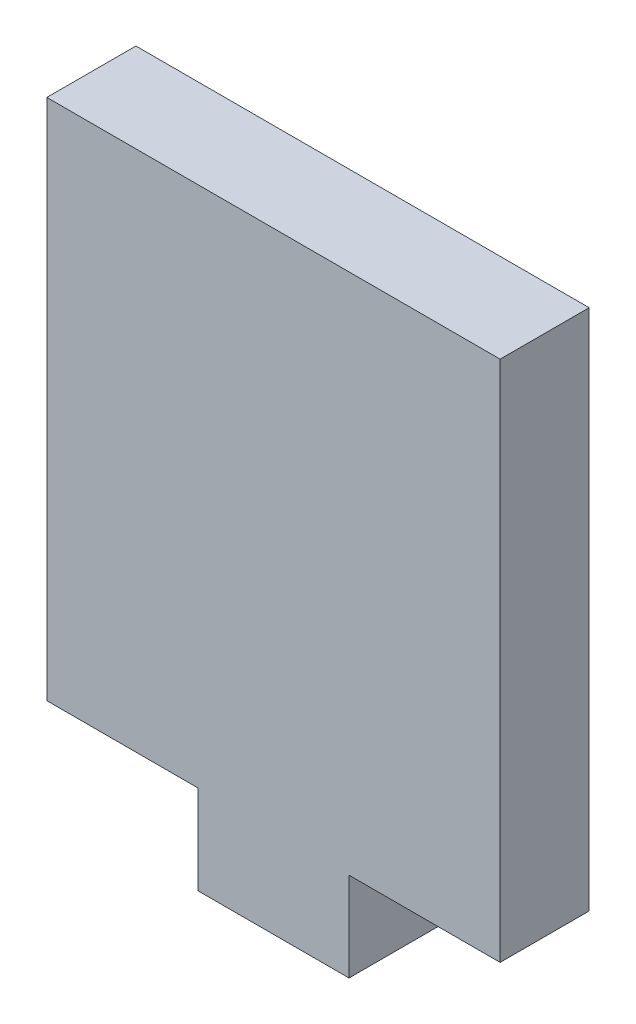
ISO-10303-21;
HEADER;
FILE_DESCRIPTION(('STEP AP214'),'2;1');
FILE_NAME('part.step','',(''),(''),'','','');
FILE_SCHEMA(('AUTOMOTIVE_DESIGN { 1 0 10303 214 1 1 1 1 }'));
ENDSEC;
DATA;
#1=APPLICATION_CONTEXT('core data for automotive mechanical design processes');
#2=APPLICATION_PROTOCOL_DEFINITION('international standard','automotive_design',2000,#1);
#3=PRODUCT_CONTEXT('',#1,'mechanical');
#4=PRODUCT('Part','Part','',(#3));
#5=PRODUCT_RELATED_PRODUCT_CATEGORY('part','',(#4));
#6=PRODUCT_DEFINITION_FORMATION('','',#4);
#7=PRODUCT_DEFINITION_CONTEXT('part definition',#1,'design');
#8=PRODUCT_DEFINITION('design','',#6,#7);
#9=PRODUCT_DEFINITION_SHAPE('','',#8);
#10=(LENGTH_UNIT() NAMED_UNIT(*) SI_UNIT(.MILLI.,.METRE.));
#11=(NAMED_UNIT(*) PLANE_ANGLE_UNIT() SI_UNIT($,.RADIAN.));
#12=(NAMED_UNIT(*) SI_UNIT($,.STERADIAN.) SOLID_ANGLE_UNIT());
#13=UNCERTAINTY_MEASURE_WITH_UNIT(LENGTH_MEASURE(1.E-05),#10,'distance_accuracy_value','');
#14=(GEOMETRIC_REPRESENTATION_CONTEXT(3) GLOBAL_UNCERTAINTY_ASSIGNED_CONTEXT((#13)) GLOBAL_UNIT_ASSIGNED_CONTEXT((#10,
#11,#12)) REPRESENTATION_CONTEXT('',''));
#15=CARTESIAN_POINT('',(0.,0.,0.));
#16=DIRECTION('',(0.,0.,1.));
#17=DIRECTION('',(1.,0.,0.));
#18=AXIS2_PLACEMENT_3D('',#15,#16,#17);
#19=CARTESIAN_POINT('',(-41.4918399668105,225.798518153976,6.));
#20=DIRECTION('',(1.,0.,0.));
#21=DIRECTION('',(0.,0.,-1.));
#22=AXIS2_PLACEMENT_3D('',#19,#20,#21);
#23=PLANE('',#22);
#24=DIRECTION('',(0.,-1.,0.));
#25=VECTOR('',#24,1.);
#26=CARTESIAN_POINT('',(-41.4918399668105,225.798518153976,0.));
#27=LINE('',#26,#25);
#28=CARTESIAN_POINT('',(-41.4918399668105,260.998518153976,0.));
#29=VERTEX_POINT('',#28);
#30=CARTESIAN_POINT('',(-41.4918399668105,225.798518153976,0.));
#31=VERTEX_POINT('',#30);
#32=EDGE_CURVE('E128',#29,#31,#27,.T.);
#33=ORIENTED_EDGE('',*,*,#32,.T.);
#34=DIRECTION('',(0.,0.,-1.));
#35=VECTOR('',#34,1.);
#36=CARTESIAN_POINT('',(-41.4918399668105,225.798518153976,6.));
#37=LINE('',#36,#35);
#38=CARTESIAN_POINT('',(-41.4918399668105,225.798518153976,6.));
#39=VERTEX_POINT('',#38);
#40=EDGE_CURVE('E11',#39,#31,#37,.T.);
#41=ORIENTED_EDGE('',*,*,#40,.F.);
#42=DIRECTION('',(0.,-1.,0.));
#43=VECTOR('',#42,1.);
#44=CARTESIAN_POINT('',(-41.4918399668105,225.798518153976,6.));
#45=LINE('',#44,#43);
#46=CARTESIAN_POINT('',(-41.4918399668105,260.998518153976,6.));
#47=VERTEX_POINT('',#46);
#48=EDGE_CURVE('E142',#47,#39,#45,.T.);
#49=ORIENTED_EDGE('',*,*,#48,.F.);
#50=DIRECTION('',(0.,0.,-1.));
#51=VECTOR('',#50,1.);
#52=CARTESIAN_POINT('',(-41.4918399668105,260.998518153976,6.));
#53=LINE('',#52,#51);
#54=EDGE_CURVE('E124',#47,#29,#53,.T.);
#55=ORIENTED_EDGE('',*,*,#54,.T.);
#56=EDGE_LOOP('',(#33,#41,#49,#55));
#57=FACE_BOUND('',#56,.T.);
#58=ADVANCED_FACE('F32',(#57),#23,.F.);
#59=CARTESIAN_POINT('',(-31.3118399668105,225.798518153976,6.));
#60=DIRECTION('',(0.,1.,0.));
#61=DIRECTION('',(-1.,0.,0.));
#62=AXIS2_PLACEMENT_3D('',#59,#60,#61);
#63=PLANE('',#62);
#64=DIRECTION('',(1.,0.,0.));
#65=VECTOR('',#64,1.);
#66=CARTESIAN_POINT('',(-31.3118399668105,225.798518153976,0.));
#67=LINE('',#66,#65);
#68=CARTESIAN_POINT('',(-31.3118399668105,225.798518153976,0.));
#69=VERTEX_POINT('',#68);
#70=EDGE_CURVE('E131',#31,#69,#67,.T.);
#71=ORIENTED_EDGE('',*,*,#70,.T.);
#72=DIRECTION('',(0.,0.,-1.));
#73=VECTOR('',#72,1.);
#74=CARTESIAN_POINT('',(-31.3118399668105,225.798518153976,6.));
#75=LINE('',#74,#73);
#76=CARTESIAN_POINT('',(-31.3118399668105,225.798518153976,6.));
#77=VERTEX_POINT('',#76);
#78=EDGE_CURVE('E40',#77,#69,#75,.T.);
#79=ORIENTED_EDGE('',*,*,#78,.F.);
#80=DIRECTION('',(1.,0.,0.));
#81=VECTOR('',#80,1.);
#82=CARTESIAN_POINT('',(-31.3118399668105,225.798518153976,6.));
#83=LINE('',#82,#81);
#84=EDGE_CURVE('E91',#39,#77,#83,.T.);
#85=ORIENTED_EDGE('',*,*,#84,.F.);
#86=ORIENTED_EDGE('',*,*,#40,.T.);
#87=EDGE_LOOP('',(#71,#79,#85,#86));
#88=FACE_BOUND('',#87,.T.);
#89=ADVANCED_FACE('F177',(#88),#63,.F.);
#90=CARTESIAN_POINT('',(-31.3118399668105,219.798518153976,6.));
#91=DIRECTION('',(1.,0.,0.));
#92=DIRECTION('',(0.,0.,-1.));
#93=AXIS2_PLACEMENT_3D('',#90,#91,#92);
#94=PLANE('',#93);
#95=DIRECTION('',(0.,-1.,0.));
#96=VECTOR('',#95,1.);
#97=CARTESIAN_POINT('',(-31.3118399668105,219.798518153976,0.));
#98=LINE('',#97,#96);
#99=CARTESIAN_POINT('',(-31.3118399668105,219.798518153976,0.));
#100=VERTEX_POINT('',#99);
#101=EDGE_CURVE('E133',#69,#100,#98,.T.);
#102=ORIENTED_EDGE('',*,*,#101,.T.);
#103=DIRECTION('',(0.,0.,-1.));
#104=VECTOR('',#103,1.);
#105=CARTESIAN_POINT('',(-31.3118399668105,219.798518153976,6.));
#106=LINE('',#105,#104);
#107=CARTESIAN_POINT('',(-31.3118399668105,219.798518153976,6.));
#108=VERTEX_POINT('',#107);
#109=EDGE_CURVE('E149',#108,#100,#106,.T.);
#110=ORIENTED_EDGE('',*,*,#109,.F.);
#111=DIRECTION('',(0.,-1.,0.));
#112=VECTOR('',#111,1.);
#113=CARTESIAN_POINT('',(-31.3118399668105,219.798518153976,6.));
#114=LINE('',#113,#112);
#115=EDGE_CURVE('E157',#77,#108,#114,.T.);
#116=ORIENTED_EDGE('',*,*,#115,.F.);
#117=ORIENTED_EDGE('',*,*,#78,.T.);
#118=EDGE_LOOP('',(#102,#110,#116,#117));
#119=FACE_BOUND('',#118,.T.);
#120=ADVANCED_FACE('F155',(#119),#94,.F.);
#121=CARTESIAN_POINT('',(-21.1318399668105,219.798518153976,6.));
#122=DIRECTION('',(0.,1.,0.));
#123=DIRECTION('',(0.,0.,1.));
#124=AXIS2_PLACEMENT_3D('',#121,#122,#123);
#125=PLANE('',#124);
#126=DIRECTION('',(1.,0.,0.));
#127=VECTOR('',#126,1.);
#128=CARTESIAN_POINT('',(-21.1318399668105,219.798518153976,0.));
#129=LINE('',#128,#127);
#130=CARTESIAN_POINT('',(-21.1318399668105,219.798518153976,0.));
#131=VERTEX_POINT('',#130);
#132=EDGE_CURVE('E135',#100,#131,#129,.T.);
#133=ORIENTED_EDGE('',*,*,#132,.T.);
#134=DIRECTION('',(0.,0.,-1.));
#135=VECTOR('',#134,1.);
#136=CARTESIAN_POINT('',(-21.1318399668105,219.798518153976,6.));
#137=LINE('',#136,#135);
#138=CARTESIAN_POINT('',(-21.1318399668105,219.798518153976,6.));
#139=VERTEX_POINT('',#138);
#140=EDGE_CURVE('E146',#139,#131,#137,.T.);
#141=ORIENTED_EDGE('',*,*,#140,.F.);
#142=DIRECTION('',(1.,0.,0.));
#143=VECTOR('',#142,1.);
#144=CARTESIAN_POINT('',(-21.1318399668105,219.798518153976,6.));
#145=LINE('',#144,#143);
#146=EDGE_CURVE('E169',#108,#139,#145,.T.);
#147=ORIENTED_EDGE('',*,*,#146,.F.);
#148=ORIENTED_EDGE('',*,*,#109,.T.);
#149=EDGE_LOOP('',(#133,#141,#147,#148));
#150=FACE_BOUND('',#149,.T.);
#151=ADVANCED_FACE('F165',(#150),#125,.F.);
#152=CARTESIAN_POINT('',(-21.1318399668105,225.798518153976,6.));
#153=DIRECTION('',(-1.,0.,0.));
#154=DIRECTION('',(0.,0.,1.));
#155=AXIS2_PLACEMENT_3D('',#152,#153,#154);
#156=PLANE('',#155);
#157=DIRECTION('',(0.,1.,0.));
#158=VECTOR('',#157,1.);
#159=CARTESIAN_POINT('',(-21.1318399668105,225.798518153976,0.));
#160=LINE('',#159,#158);
#161=CARTESIAN_POINT('',(-21.1318399668105,225.798518153976,0.));
#162=VERTEX_POINT('',#161);
#163=EDGE_CURVE('E137',#131,#162,#160,.T.);
#164=ORIENTED_EDGE('',*,*,#163,.T.);
#165=DIRECTION('',(0.,0.,-1.));
#166=VECTOR('',#165,1.);
#167=CARTESIAN_POINT('',(-21.1318399668105,225.798518153976,6.));
#168=LINE('',#167,#166);
#169=CARTESIAN_POINT('',(-21.1318399668105,225.798518153976,6.));
#170=VERTEX_POINT('',#169);
#171=EDGE_CURVE('E119',#170,#162,#168,.T.);
#172=ORIENTED_EDGE('',*,*,#171,.F.);
#173=DIRECTION('',(0.,1.,0.));
#174=VECTOR('',#173,1.);
#175=CARTESIAN_POINT('',(-21.1318399668105,225.798518153976,6.));
#176=LINE('',#175,#174);
#177=EDGE_CURVE('E110',#139,#170,#176,.T.);
#178=ORIENTED_EDGE('',*,*,#177,.F.);
#179=ORIENTED_EDGE('',*,*,#140,.T.);
#180=EDGE_LOOP('',(#164,#172,#178,#179));
#181=FACE_BOUND('',#180,.T.);
#182=ADVANCED_FACE('F168',(#181),#156,.F.);
#183=CARTESIAN_POINT('',(-10.9518399668105,225.798518153976,6.));
#184=DIRECTION('',(0.,1.,0.));
#185=DIRECTION('',(0.,0.,1.));
#186=AXIS2_PLACEMENT_3D('',#183,#184,#185);
#187=PLANE('',#186);
#188=DIRECTION('',(1.,0.,0.));
#189=VECTOR('',#188,1.);
#190=CARTESIAN_POINT('',(-10.9518399668105,225.798518153976,0.));
#191=LINE('',#190,#189);
#192=CARTESIAN_POINT('',(-10.9518399668105,225.798518153976,0.));
#193=VERTEX_POINT('',#192);
#194=EDGE_CURVE('E118',#162,#193,#191,.T.);
#195=ORIENTED_EDGE('',*,*,#194,.T.);
#196=DIRECTION('',(0.,0.,-1.));
#197=VECTOR('',#196,1.);
#198=CARTESIAN_POINT('',(-10.9518399668105,225.798518153976,6.));
#199=LINE('',#198,#197);
#200=CARTESIAN_POINT('',(-10.9518399668105,225.798518153976,6.));
#201=VERTEX_POINT('',#200);
#202=EDGE_CURVE('E115',#201,#193,#199,.T.);
#203=ORIENTED_EDGE('',*,*,#202,.F.);
#204=DIRECTION('',(1.,0.,0.));
#205=VECTOR('',#204,1.);
#206=CARTESIAN_POINT('',(-10.9518399668105,225.798518153976,6.));
#207=LINE('',#206,#205);
#208=EDGE_CURVE('E104',#170,#201,#207,.T.);
#209=ORIENTED_EDGE('',*,*,#208,.F.);
#210=ORIENTED_EDGE('',*,*,#171,.T.);
#211=EDGE_LOOP('',(#195,#203,#209,#210));
#212=FACE_BOUND('',#211,.T.);
#213=ADVANCED_FACE('F116',(#212),#187,.F.);
#214=CARTESIAN_POINT('',(-10.9518399668105,260.998518153976,6.));
#215=DIRECTION('',(-1.,0.,0.));
#216=DIRECTION('',(0.,-1.,0.));
#217=AXIS2_PLACEMENT_3D('',#214,#215,#216);
#218=PLANE('',#217);
#219=DIRECTION('',(0.,1.,0.));
#220=VECTOR('',#219,1.);
#221=CARTESIAN_POINT('',(-10.9518399668105,260.998518153976,0.));
#222=LINE('',#221,#220);
#223=CARTESIAN_POINT('',(-10.9518399668105,260.998518153976,0.));
#224=VERTEX_POINT('',#223);
#225=EDGE_CURVE('E77',#193,#224,#222,.T.);
#226=ORIENTED_EDGE('',*,*,#225,.T.);
#227=DIRECTION('',(0.,0.,-1.));
#228=VECTOR('',#227,1.);
#229=CARTESIAN_POINT('',(-10.9518399668105,260.998518153976,6.));
#230=LINE('',#229,#228);
#231=CARTESIAN_POINT('',(-10.9518399668105,260.998518153976,6.));
#232=VERTEX_POINT('',#231);
#233=EDGE_CURVE('E120',#232,#224,#230,.T.);
#234=ORIENTED_EDGE('',*,*,#233,.F.);
#235=DIRECTION('',(0.,1.,0.));
#236=VECTOR('',#235,1.);
#237=CARTESIAN_POINT('',(-10.9518399668105,260.998518153976,6.));
#238=LINE('',#237,#236);
#239=EDGE_CURVE('E108',#201,#232,#238,.T.);
#240=ORIENTED_EDGE('',*,*,#239,.F.);
#241=ORIENTED_EDGE('',*,*,#202,.T.);
#242=EDGE_LOOP('',(#226,#234,#240,#241));
#243=FACE_BOUND('',#242,.T.);
#244=ADVANCED_FACE('F122',(#243),#218,.F.);
#245=CARTESIAN_POINT('',(-41.4918399668105,260.998518153976,6.));
#246=DIRECTION('',(0.,-1.,0.));
#247=DIRECTION('',(1.,0.,0.));
#248=AXIS2_PLACEMENT_3D('',#245,#246,#247);
#249=PLANE('',#248);
#250=DIRECTION('',(-1.,0.,0.));
#251=VECTOR('',#250,1.);
#252=CARTESIAN_POINT('',(-41.4918399668105,260.998518153976,0.));
#253=LINE('',#252,#251);
#254=EDGE_CURVE('E83',#224,#29,#253,.T.);
#255=ORIENTED_EDGE('',*,*,#254,.T.);
#256=ORIENTED_EDGE('',*,*,#54,.F.);
#257=DIRECTION('',(-1.,0.,0.));
#258=VECTOR('',#257,1.);
#259=CARTESIAN_POINT('',(-41.4918399668105,260.998518153976,6.));
#260=LINE('',#259,#258);
#261=EDGE_CURVE('E48',#232,#47,#260,.T.);
#262=ORIENTED_EDGE('',*,*,#261,.F.);
#263=ORIENTED_EDGE('',*,*,#233,.T.);
#264=EDGE_LOOP('',(#255,#256,#262,#263));
#265=FACE_BOUND('',#264,.T.);
#266=ADVANCED_FACE('F193',(#265),#249,.F.);
#267=CARTESIAN_POINT('',(0.,0.,6.));
#268=DIRECTION('',(0.,0.,-1.));
#269=DIRECTION('',(-1.,0.,0.));
#270=AXIS2_PLACEMENT_3D('',#267,#268,#269);
#271=PLANE('',#270);
#272=ORIENTED_EDGE('',*,*,#48,.T.);
#273=ORIENTED_EDGE('',*,*,#84,.T.);
#274=ORIENTED_EDGE('',*,*,#115,.T.);
#275=ORIENTED_EDGE('',*,*,#146,.T.);
#276=ORIENTED_EDGE('',*,*,#177,.T.);
#277=ORIENTED_EDGE('',*,*,#208,.T.);
#278=ORIENTED_EDGE('',*,*,#239,.T.);
#279=ORIENTED_EDGE('',*,*,#261,.T.);
#280=EDGE_LOOP('',(#272,#273,#274,#275,#276,#277,#278,#279));
#281=FACE_BOUND('',#280,.T.);
#282=ADVANCED_FACE('F106',(#281),#271,.F.);
#283=CARTESIAN_POINT('',(0.,0.,0.));
#284=DIRECTION('',(0.,0.,-1.));
#285=DIRECTION('',(-1.,0.,0.));
#286=AXIS2_PLACEMENT_3D('',#283,#284,#285);
#287=PLANE('',#286);
#288=ORIENTED_EDGE('',*,*,#32,.F.);
#289=ORIENTED_EDGE('',*,*,#254,.F.);
#290=ORIENTED_EDGE('',*,*,#225,.F.);
#291=ORIENTED_EDGE('',*,*,#194,.F.);
#292=ORIENTED_EDGE('',*,*,#163,.F.);
#293=ORIENTED_EDGE('',*,*,#132,.F.);
#294=ORIENTED_EDGE('',*,*,#101,.F.);
#295=ORIENTED_EDGE('',*,*,#70,.F.);
#296=EDGE_LOOP('',(#288,#289,#290,#291,#292,#293,#294,#295));
#297=FACE_BOUND('',#296,.T.);
#298=ADVANCED_FACE('F161',(#297),#287,.T.);
#299=CLOSED_SHELL('',(#58,#89,#120,#151,#182,#213,#244,#266,#282,#298));
#300=MANIFOLD_SOLID_BREP('B2',#299);
#301=ADVANCED_BREP_SHAPE_REPRESENTATION('',(#18,#300),#14);
#302=SHAPE_DEFINITION_REPRESENTATION(#9,#301);
ENDSEC;
END-ISO-10303-21;
